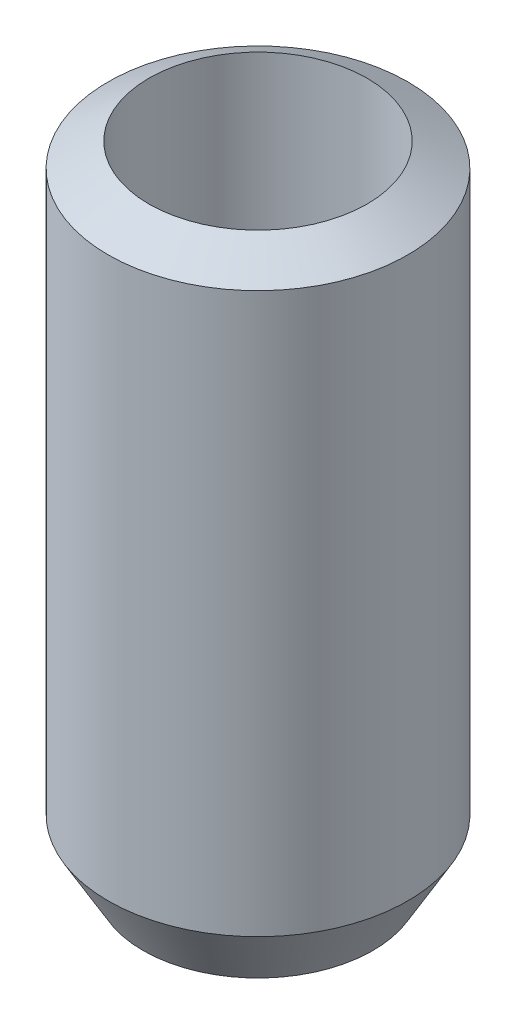
ISO-10303-21;
HEADER;
FILE_DESCRIPTION(('STEP AP214'),'2;1');
FILE_NAME('part.step','',(''),(''),'','','');
FILE_SCHEMA(('AUTOMOTIVE_DESIGN { 1 0 10303 214 1 1 1 1 }'));
ENDSEC;
DATA;
#1=APPLICATION_CONTEXT('core data for automotive mechanical design processes');
#2=APPLICATION_PROTOCOL_DEFINITION('international standard','automotive_design',2000,#1);
#3=PRODUCT_CONTEXT('',#1,'mechanical');
#4=PRODUCT('Part','Part','',(#3));
#5=PRODUCT_RELATED_PRODUCT_CATEGORY('part','',(#4));
#6=PRODUCT_DEFINITION_FORMATION('','',#4);
#7=PRODUCT_DEFINITION_CONTEXT('part definition',#1,'design');
#8=PRODUCT_DEFINITION('design','',#6,#7);
#9=PRODUCT_DEFINITION_SHAPE('','',#8);
#10=(LENGTH_UNIT() NAMED_UNIT(*) SI_UNIT(.MILLI.,.METRE.));
#11=(NAMED_UNIT(*) PLANE_ANGLE_UNIT() SI_UNIT($,.RADIAN.));
#12=(NAMED_UNIT(*) SI_UNIT($,.STERADIAN.) SOLID_ANGLE_UNIT());
#13=UNCERTAINTY_MEASURE_WITH_UNIT(LENGTH_MEASURE(1.E-05),#10,'distance_accuracy_value','');
#14=(GEOMETRIC_REPRESENTATION_CONTEXT(3) GLOBAL_UNCERTAINTY_ASSIGNED_CONTEXT((#13)) GLOBAL_UNIT_ASSIGNED_CONTEXT((#10,
#11,#12)) REPRESENTATION_CONTEXT('',''));
#15=CARTESIAN_POINT('',(0.,0.,0.));
#16=DIRECTION('',(0.,0.,1.));
#17=DIRECTION('',(1.,0.,0.));
#18=AXIS2_PLACEMENT_3D('',#15,#16,#17);
#19=CARTESIAN_POINT('',(0.,87.3976015852722,0.));
#20=DIRECTION('',(0.,-1.,0.));
#21=DIRECTION('',(0.,0.,-1.));
#22=AXIS2_PLACEMENT_3D('',#19,#20,#21);
#23=CYLINDRICAL_SURFACE('',#22,20.);
#24=CARTESIAN_POINT('',(0.,82.7364721271149,0.));
#25=DIRECTION('',(0.,1.,0.));
#26=DIRECTION('',(0.,0.,1.));
#27=AXIS2_PLACEMENT_3D('',#24,#25,#26);
#28=CIRCLE('',#27,20.);
#29=CARTESIAN_POINT('',(0.,82.7364721271149,-20.));
#30=VERTEX_POINT('',#29);
#31=EDGE_CURVE('E50',#30,#30,#28,.F.);
#32=CARTESIAN_POINT('',(0.,8.07331304218451,0.));
#33=DIRECTION('',(0.,1.,0.));
#34=DIRECTION('',(0.,0.,1.));
#35=AXIS2_PLACEMENT_3D('',#32,#33,#34);
#36=CIRCLE('',#35,20.);
#37=CARTESIAN_POINT('',(0.,8.07331304218449,-20.));
#38=VERTEX_POINT('',#37);
#39=EDGE_CURVE('E51',#38,#38,#36,.T.);
#40=CARTESIAN_POINT('',(0.,82.7364721271149,-20.));
#41=CARTESIAN_POINT('',(0.,81.9587308866469,-20.));
#42=CARTESIAN_POINT('',(0.,81.1809896461788,-20.));
#43=CARTESIAN_POINT('',(0.,79.6255071652428,-20.));
#44=CARTESIAN_POINT('',(0.,78.8477659247748,-20.));
#45=CARTESIAN_POINT('',(0.,77.2922834438387,-20.));
#46=CARTESIAN_POINT('',(0.,76.5145422033707,-20.));
#47=CARTESIAN_POINT('',(0.,74.9590597224346,-20.));
#48=CARTESIAN_POINT('',(0.,74.1813184819666,-20.));
#49=CARTESIAN_POINT('',(0.,72.6258360010306,-20.));
#50=CARTESIAN_POINT('',(0.,71.8480947605625,-20.));
#51=CARTESIAN_POINT('',(0.,70.2926122796265,-20.));
#52=CARTESIAN_POINT('',(0.,69.5148710391585,-20.));
#53=CARTESIAN_POINT('',(0.,67.9593885582224,-20.));
#54=CARTESIAN_POINT('',(0.,67.1816473177544,-20.));
#55=CARTESIAN_POINT('',(0.,65.6261648368183,-20.));
#56=CARTESIAN_POINT('',(0.,64.8484235963503,-20.));
#57=CARTESIAN_POINT('',(0.,63.2929411154143,-20.));
#58=CARTESIAN_POINT('',(0.,62.5151998749462,-20.));
#59=CARTESIAN_POINT('',(0.,60.9597173940102,-20.));
#60=CARTESIAN_POINT('',(0.,60.1819761535422,-20.));
#61=CARTESIAN_POINT('',(0.,58.6264936726061,-20.));
#62=CARTESIAN_POINT('',(0.,57.8487524321381,-20.));
#63=CARTESIAN_POINT('',(0.,56.293269951202,-20.));
#64=CARTESIAN_POINT('',(0.,55.515528710734,-20.));
#65=CARTESIAN_POINT('',(0.,53.960046229798,-20.));
#66=CARTESIAN_POINT('',(0.,53.1823049893299,-20.));
#67=CARTESIAN_POINT('',(0.,51.6268225083939,-20.));
#68=CARTESIAN_POINT('',(0.,50.8490812679259,-20.));
#69=CARTESIAN_POINT('',(0.,49.2935987869898,-20.));
#70=CARTESIAN_POINT('',(0.,48.5158575465218,-20.));
#71=CARTESIAN_POINT('',(0.,46.9603750655857,-20.));
#72=CARTESIAN_POINT('',(0.,46.1826338251177,-20.));
#73=CARTESIAN_POINT('',(0.,44.6271513441817,-20.));
#74=CARTESIAN_POINT('',(0.,43.8494101037136,-20.));
#75=CARTESIAN_POINT('',(0.,42.2939276227776,-20.));
#76=CARTESIAN_POINT('',(0.,41.5161863823096,-20.));
#77=CARTESIAN_POINT('',(0.,39.9607039013735,-20.));
#78=CARTESIAN_POINT('',(0.,39.1829626609055,-20.));
#79=CARTESIAN_POINT('',(0.,37.6274801799694,-20.));
#80=CARTESIAN_POINT('',(0.,36.8497389395014,-20.));
#81=CARTESIAN_POINT('',(0.,35.2942564585654,-20.));
#82=CARTESIAN_POINT('',(0.,34.5165152180973,-20.));
#83=CARTESIAN_POINT('',(0.,32.9610327371613,-20.));
#84=CARTESIAN_POINT('',(0.,32.1832914966933,-20.));
#85=CARTESIAN_POINT('',(0.,30.6278090157572,-20.));
#86=CARTESIAN_POINT('',(0.,29.8500677752892,-20.));
#87=CARTESIAN_POINT('',(0.,28.2945852943531,-20.));
#88=CARTESIAN_POINT('',(0.,27.5168440538851,-20.));
#89=CARTESIAN_POINT('',(0.,25.9613615729491,-20.));
#90=CARTESIAN_POINT('',(0.,25.183620332481,-20.));
#91=CARTESIAN_POINT('',(0.,23.628137851545,-20.));
#92=CARTESIAN_POINT('',(0.,22.850396611077,-20.));
#93=CARTESIAN_POINT('',(0.,21.2949141301409,-20.));
#94=CARTESIAN_POINT('',(0.,20.5171728896729,-20.));
#95=CARTESIAN_POINT('',(0.,18.9616904087368,-20.));
#96=CARTESIAN_POINT('',(0.,18.1839491682688,-20.));
#97=CARTESIAN_POINT('',(0.,16.6284666873328,-20.));
#98=CARTESIAN_POINT('',(0.,15.8507254468648,-20.));
#99=CARTESIAN_POINT('',(0.,14.2952429659287,-20.));
#100=CARTESIAN_POINT('',(0.,13.5175017254607,-20.));
#101=CARTESIAN_POINT('',(0.,11.9620192445246,-20.));
#102=CARTESIAN_POINT('',(0.,11.1842780040566,-20.));
#103=CARTESIAN_POINT('',(0.,9.62879552312054,-20.));
#104=CARTESIAN_POINT('',(0.,8.85105428265251,-20.));
#105=CARTESIAN_POINT('',(0.,8.07331304218449,-20.));
#106=B_SPLINE_CURVE_WITH_KNOTS('',3,(#40,#41,#42,#43,#44,#45,#46,#47,#48,#49,#50,#51,#52,#53,
#54,#55,#56,#57,#58,#59,#60,#61,#62,#63,#64,#65,#66,#67,#68,#69,#70,#71,#72,#73,#74,#75,#76,#77,
#78,#79,#80,#81,#82,#83,#84,#85,#86,#87,#88,#89,#90,#91,#92,#93,#94,#95,#96,#97,#98,#99,#100,
#101,#102,#103,#104,#105),.UNSPECIFIED.,.F.,.F.,(4,2,2,2,2,2,2,2,2,2,2,2,2,2,2,2,2,2,2,2,2,2,2,
2,2,2,2,2,2,2,2,2,4),(0.,2.33322372140408,4.66644744280816,6.99967116421223,9.33289488561631,
11.6661186070204,13.9993423284245,16.3325660498285,18.6657897712326,20.9990134926367,
23.3322372140407,25.6654609354448,27.9986846568489,30.331908378253,32.6651320996571,
34.9983558210611,37.3315795424652,39.6648032638693,41.9980269852733,44.3312507066774,
46.6644744280815,48.9976981494856,51.3309218708897,53.6641455922937,55.9973693136978,
58.3305930351019,60.663816756506,62.99704047791,65.3302641993141,67.6634879207182,
69.9967116421222,72.3299353635263,74.6631590849304),.UNSPECIFIED.);
#107=EDGE_CURVE('BSEAM39',#30,#38,#106,.T.);
#108=ORIENTED_EDGE('',*,*,#31,.T.);
#109=ORIENTED_EDGE('',*,*,#39,.T.);
#110=ORIENTED_EDGE('',*,*,#107,.T.);
#111=ORIENTED_EDGE('',*,*,#107,.F.);
#112=EDGE_LOOP('',(#108,#110,#109,#111));
#113=FACE_BOUND('',#112,.T.);
#114=ADVANCED_FACE('F39',(#113),#23,.T.);
#115=CARTESIAN_POINT('',(0.,0.,0.));
#116=DIRECTION('',(0.,1.,0.));
#117=DIRECTION('',(0.,0.,1.));
#118=AXIS2_PLACEMENT_3D('',#115,#116,#117);
#119=PLANE('',#118);
#120=CARTESIAN_POINT('',(0.,0.,0.));
#121=DIRECTION('',(0.,1.,0.));
#122=DIRECTION('',(0.,0.,1.));
#123=AXIS2_PLACEMENT_3D('',#120,#121,#122);
#124=CIRCLE('',#123,15.3388705418426);
#125=CARTESIAN_POINT('',(0.,0.,15.3388705418426));
#126=VERTEX_POINT('',#125);
#127=EDGE_CURVE('E10',#126,#126,#124,.F.);
#128=ORIENTED_EDGE('',*,*,#127,.T.);
#129=EDGE_LOOP('',(#128));
#130=FACE_BOUND('',#129,.T.);
#131=CARTESIAN_POINT('',(0.,0.,0.));
#132=DIRECTION('',(0.,1.,0.));
#133=DIRECTION('',(0.,0.,1.));
#134=AXIS2_PLACEMENT_3D('',#131,#132,#133);
#135=CIRCLE('',#134,14.5548055181069);
#136=CARTESIAN_POINT('',(0.,0.,-14.5548055181069));
#137=VERTEX_POINT('',#136);
#138=EDGE_CURVE('E58',#137,#137,#135,.T.);
#139=ORIENTED_EDGE('',*,*,#138,.T.);
#140=EDGE_LOOP('',(#139));
#141=FACE_BOUND('',#140,.T.);
#142=ADVANCED_FACE('F62',(#130,#141),#119,.F.);
#143=CARTESIAN_POINT('',(0.,87.3976015852722,0.));
#144=DIRECTION('',(0.,-1.,0.));
#145=DIRECTION('',(0.,0.,-1.));
#146=AXIS2_PLACEMENT_3D('',#143,#144,#145);
#147=CYLINDRICAL_SURFACE('',#146,14.5548055181069);
#148=CARTESIAN_POINT('',(0.,85.8802566270257,0.));
#149=DIRECTION('',(0.,-1.,0.));
#150=DIRECTION('',(0.,0.,-1.));
#151=AXIS2_PLACEMENT_3D('',#148,#149,#150);
#152=CIRCLE('',#151,14.5548055181069);
#153=CARTESIAN_POINT('',(0.,85.8802566270257,-14.5548055181069));
#154=VERTEX_POINT('',#153);
#155=EDGE_CURVE('E54',#154,#154,#152,.F.);
#156=CARTESIAN_POINT('',(0.,85.8802566270257,-14.5548055181069));
#157=CARTESIAN_POINT('',(0.,84.9856706204942,-14.5548055181069));
#158=CARTESIAN_POINT('',(0.,84.0910846139627,-14.5548055181069));
#159=CARTESIAN_POINT('',(0.,82.3019126008997,-14.5548055181069));
#160=CARTESIAN_POINT('',(0.,81.4073265943682,-14.5548055181069));
#161=CARTESIAN_POINT('',(0.,79.6181545813051,-14.5548055181069));
#162=CARTESIAN_POINT('',(0.,78.7235685747736,-14.5548055181069));
#163=CARTESIAN_POINT('',(0.,76.9343965617106,-14.5548055181069));
#164=CARTESIAN_POINT('',(0.,76.039810555179,-14.5548055181069));
#165=CARTESIAN_POINT('',(0.,74.250638542116,-14.5548055181069));
#166=CARTESIAN_POINT('',(0.,73.3560525355845,-14.5548055181069));
#167=CARTESIAN_POINT('',(0.,71.5668805225215,-14.5548055181069));
#168=CARTESIAN_POINT('',(0.,70.6722945159899,-14.5548055181069));
#169=CARTESIAN_POINT('',(0.,68.8831225029269,-14.5548055181069));
#170=CARTESIAN_POINT('',(0.,67.9885364963954,-14.5548055181069));
#171=CARTESIAN_POINT('',(0.,66.1993644833323,-14.5548055181069));
#172=CARTESIAN_POINT('',(0.,65.3047784768008,-14.5548055181069));
#173=CARTESIAN_POINT('',(0.,63.5156064637378,-14.5548055181069));
#174=CARTESIAN_POINT('',(0.,62.6210204572063,-14.5548055181069));
#175=CARTESIAN_POINT('',(0.,60.8318484441432,-14.5548055181069));
#176=CARTESIAN_POINT('',(0.,59.9372624376117,-14.5548055181069));
#177=CARTESIAN_POINT('',(0.,58.1480904245487,-14.5548055181069));
#178=CARTESIAN_POINT('',(0.,57.2535044180172,-14.5548055181069));
#179=CARTESIAN_POINT('',(0.,55.4643324049541,-14.5548055181069));
#180=CARTESIAN_POINT('',(0.,54.5697463984226,-14.5548055181069));
#181=CARTESIAN_POINT('',(0.,52.7805743853596,-14.5548055181069));
#182=CARTESIAN_POINT('',(0.,51.8859883788281,-14.5548055181069));
#183=CARTESIAN_POINT('',(0.,50.096816365765,-14.5548055181069));
#184=CARTESIAN_POINT('',(0.,49.2022303592335,-14.5548055181069));
#185=CARTESIAN_POINT('',(0.,47.4130583461705,-14.5548055181069));
#186=CARTESIAN_POINT('',(0.,46.5184723396389,-14.5548055181069));
#187=CARTESIAN_POINT('',(0.,44.7293003265759,-14.5548055181069));
#188=CARTESIAN_POINT('',(0.,43.8347143200444,-14.5548055181069));
#189=CARTESIAN_POINT('',(0.,42.0455423069813,-14.5548055181069));
#190=CARTESIAN_POINT('',(0.,41.1509563004498,-14.5548055181069));
#191=CARTESIAN_POINT('',(0.,39.3617842873868,-14.5548055181069));
#192=CARTESIAN_POINT('',(0.,38.4671982808553,-14.5548055181069));
#193=CARTESIAN_POINT('',(0.,36.6780262677922,-14.5548055181069));
#194=CARTESIAN_POINT('',(0.,35.7834402612607,-14.5548055181069));
#195=CARTESIAN_POINT('',(0.,33.9942682481977,-14.5548055181069));
#196=CARTESIAN_POINT('',(0.,33.0996822416662,-14.5548055181069));
#197=CARTESIAN_POINT('',(0.,31.3105102286031,-14.5548055181069));
#198=CARTESIAN_POINT('',(0.,30.4159242220716,-14.5548055181069));
#199=CARTESIAN_POINT('',(0.,28.6267522090086,-14.5548055181069));
#200=CARTESIAN_POINT('',(0.,27.7321662024771,-14.5548055181069));
#201=CARTESIAN_POINT('',(0.,25.942994189414,-14.5548055181069));
#202=CARTESIAN_POINT('',(0.,25.0484081828825,-14.5548055181069));
#203=CARTESIAN_POINT('',(0.,23.2592361698195,-14.5548055181069));
#204=CARTESIAN_POINT('',(0.,22.3646501632879,-14.5548055181069));
#205=CARTESIAN_POINT('',(0.,20.5754781502249,-14.5548055181069));
#206=CARTESIAN_POINT('',(0.,19.6808921436934,-14.5548055181069));
#207=CARTESIAN_POINT('',(0.,17.8917201306304,-14.5548055181069));
#208=CARTESIAN_POINT('',(0.,16.9971341240988,-14.5548055181069));
#209=CARTESIAN_POINT('',(0.,15.2079621110358,-14.5548055181069));
#210=CARTESIAN_POINT('',(0.,14.3133761045043,-14.5548055181069));
#211=CARTESIAN_POINT('',(0.,12.5242040914412,-14.5548055181069));
#212=CARTESIAN_POINT('',(0.,11.6296180849097,-14.5548055181069));
#213=CARTESIAN_POINT('',(0.,9.84044607184669,-14.5548055181069));
#214=CARTESIAN_POINT('',(0.,8.94586006531518,-14.5548055181069));
#215=CARTESIAN_POINT('',(0.,7.15668805225214,-14.5548055181069));
#216=CARTESIAN_POINT('',(0.,6.26210204572062,-14.5548055181069));
#217=CARTESIAN_POINT('',(0.,4.47293003265758,-14.5548055181069));
#218=CARTESIAN_POINT('',(0.,3.57834402612606,-14.5548055181069));
#219=CARTESIAN_POINT('',(0.,1.78917201306302,-14.5548055181069));
#220=CARTESIAN_POINT('',(0.,0.894586006531505,-14.5548055181069));
#221=CARTESIAN_POINT('',(0.,0.,-14.5548055181069));
#222=B_SPLINE_CURVE_WITH_KNOTS('',3,(#156,#157,#158,#159,#160,#161,#162,#163,#164,#165,#166,
#167,#168,#169,#170,#171,#172,#173,#174,#175,#176,#177,#178,#179,#180,#181,#182,#183,#184,#185,
#186,#187,#188,#189,#190,#191,#192,#193,#194,#195,#196,#197,#198,#199,#200,#201,#202,#203,#204,
#205,#206,#207,#208,#209,#210,#211,#212,#213,#214,#215,#216,#217,#218,#219,#220,#221),
.UNSPECIFIED.,.F.,.F.,(4,2,2,2,2,2,2,2,2,2,2,2,2,2,2,2,2,2,2,2,2,2,2,2,2,2,2,2,2,2,2,2,4),(0.,
2.68375801959454,5.3675160391891,8.05127405878366,10.7350320783782,13.4187900979728,
16.1025481175673,18.7863061371619,21.4700641567564,24.153822176351,26.8375801959455,
29.5213382155401,32.2050962351346,34.8888542547292,37.5726122743238,40.2563702939183,
42.9401283135129,45.6238863331074,48.307644352702,50.9914023722965,53.6751603918911,
56.3589184114856,59.0426764310802,61.7264344506748,64.4101924702693,67.0939504898639,
69.7777085094584,72.461466529053,75.1452245486475,77.8289825682421,80.5127405878366,
83.1964986074312,85.8802566270258),.UNSPECIFIED.);
#223=EDGE_CURVE('BSEAM68',#154,#137,#222,.T.);
#224=ORIENTED_EDGE('',*,*,#155,.T.);
#225=ORIENTED_EDGE('',*,*,#138,.F.);
#226=ORIENTED_EDGE('',*,*,#223,.T.);
#227=ORIENTED_EDGE('',*,*,#223,.F.);
#228=EDGE_LOOP('',(#224,#226,#225,#227));
#229=FACE_BOUND('',#228,.T.);
#230=ADVANCED_FACE('F68',(#229),#147,.F.);
#231=CARTESIAN_POINT('',(0.,87.3976015852722,0.));
#232=DIRECTION('',(0.,-1.,0.));
#233=DIRECTION('',(0.,0.,-1.));
#234=AXIS2_PLACEMENT_3D('',#231,#232,#233);
#235=CONICAL_SURFACE('',#234,11.9266869578156,1.0471975511966);
#236=ORIENTED_EDGE('',*,*,#31,.F.);
#237=EDGE_LOOP('',(#236));
#238=FACE_BOUND('',#237,.T.);
#239=ORIENTED_EDGE('',*,*,#155,.F.);
#240=EDGE_LOOP('',(#239));
#241=FACE_BOUND('',#240,.T.);
#242=ADVANCED_FACE('F66',(#238,#241),#235,.T.);
#243=CARTESIAN_POINT('',(0.,8.07331304218451,0.));
#244=DIRECTION('',(0.,1.,0.));
#245=DIRECTION('',(0.,0.,1.));
#246=AXIS2_PLACEMENT_3D('',#243,#244,#245);
#247=CONICAL_SURFACE('',#246,20.,0.523598775598302);
#248=ORIENTED_EDGE('',*,*,#127,.F.);
#249=EDGE_LOOP('',(#248));
#250=FACE_BOUND('',#249,.T.);
#251=ORIENTED_EDGE('',*,*,#39,.F.);
#252=EDGE_LOOP('',(#251));
#253=FACE_BOUND('',#252,.T.);
#254=ADVANCED_FACE('F45',(#250,#253),#247,.T.);
#255=CLOSED_SHELL('',(#114,#142,#230,#242,#254));
#256=MANIFOLD_SOLID_BREP('B2',#255);
#257=ADVANCED_BREP_SHAPE_REPRESENTATION('',(#18,#256),#14);
#258=SHAPE_DEFINITION_REPRESENTATION(#9,#257);
ENDSEC;
END-ISO-10303-21;
